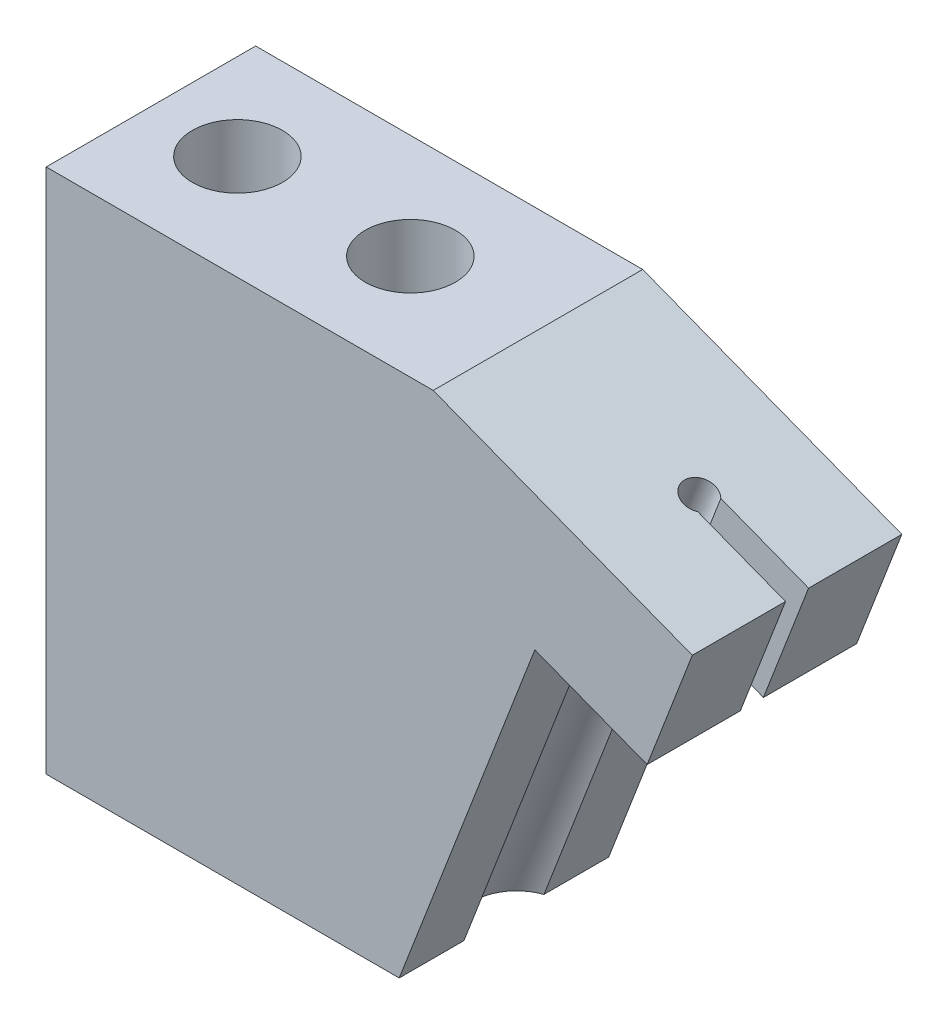
ISO-10303-21;
HEADER;
FILE_DESCRIPTION(('STEP AP214'),'2;1');
FILE_NAME('part.step','',(''),(''),'','','');
FILE_SCHEMA(('AUTOMOTIVE_DESIGN { 1 0 10303 214 1 1 1 1 }'));
ENDSEC;
DATA;
#1=APPLICATION_CONTEXT('core data for automotive mechanical design processes');
#2=APPLICATION_PROTOCOL_DEFINITION('international standard','automotive_design',2000,#1);
#3=PRODUCT_CONTEXT('',#1,'mechanical');
#4=PRODUCT('Part','Part','',(#3));
#5=PRODUCT_RELATED_PRODUCT_CATEGORY('part','',(#4));
#6=PRODUCT_DEFINITION_FORMATION('','',#4);
#7=PRODUCT_DEFINITION_CONTEXT('part definition',#1,'design');
#8=PRODUCT_DEFINITION('design','',#6,#7);
#9=PRODUCT_DEFINITION_SHAPE('','',#8);
#10=(LENGTH_UNIT() NAMED_UNIT(*) SI_UNIT(.MILLI.,.METRE.));
#11=(NAMED_UNIT(*) PLANE_ANGLE_UNIT() SI_UNIT($,.RADIAN.));
#12=(NAMED_UNIT(*) SI_UNIT($,.STERADIAN.) SOLID_ANGLE_UNIT());
#13=UNCERTAINTY_MEASURE_WITH_UNIT(LENGTH_MEASURE(1.E-05),#10,'distance_accuracy_value','');
#14=(GEOMETRIC_REPRESENTATION_CONTEXT(3) GLOBAL_UNCERTAINTY_ASSIGNED_CONTEXT((#13)) GLOBAL_UNIT_ASSIGNED_CONTEXT((#10,
#11,#12)) REPRESENTATION_CONTEXT('',''));
#15=CARTESIAN_POINT('',(0.,0.,0.));
#16=DIRECTION('',(0.,0.,1.));
#17=DIRECTION('',(1.,0.,0.));
#18=AXIS2_PLACEMENT_3D('',#15,#16,#17);
#19=CARTESIAN_POINT('',(-9.14111945311414,-0.764826871846283,-5.));
#20=DIRECTION('',(-0.359508265466264,-0.933141900817576,0.));
#21=DIRECTION('',(0.933141900817576,-0.359508265466264,0.));
#22=AXIS2_PLACEMENT_3D('',#19,#20,#21);
#23=PLANE('',#22);
#24=DIRECTION('',(0.933141900817576,-0.359508265466264,0.));
#25=VECTOR('',#24,1.);
#26=CARTESIAN_POINT('',(-25.2303841588295,5.43382698981338,-0.549999999999999));
#27=LINE('',#26,#25);
#28=CARTESIAN_POINT('',(0.404774537299763,-4.44253954106811,-0.549999999999999));
#29=VERTEX_POINT('',#28);
#30=CARTESIAN_POINT('',(3.22767644222282,-5.53010893060162,-0.549999999999999));
#31=VERTEX_POINT('',#30);
#32=EDGE_CURVE('E177',#29,#31,#27,.T.);
#33=ORIENTED_EDGE('',*,*,#32,.F.);
#34=CARTESIAN_POINT('',(-1.43803306186506,-3.73256760327029,0.));
#35=DIRECTION('',(0.359508265466264,0.933141900817576,0.));
#36=DIRECTION('',(-0.933141900817576,0.359508265466264,0.));
#37=AXIS2_PLACEMENT_3D('',#34,#35,#36);
#38=CIRCLE('',#37,2.05);
#39=CARTESIAN_POINT('',(-2.13322377797415,-3.46473394549793,-1.90983638042635));
#40=VERTEX_POINT('',#39);
#41=EDGE_CURVE('E262',#29,#40,#38,.T.);
#42=ORIENTED_EDGE('',*,*,#41,.T.);
#43=DIRECTION('',(0.,0.,1.));
#44=VECTOR('',#43,1.);
#45=CARTESIAN_POINT('',(-2.13322377797415,-3.46473394549793,-5.));
#46=LINE('',#45,#44);
#47=CARTESIAN_POINT('',(-2.13322377797415,-3.46473394549793,-5.));
#48=VERTEX_POINT('',#47);
#49=EDGE_CURVE('E310',#48,#40,#46,.T.);
#50=ORIENTED_EDGE('',*,*,#49,.F.);
#51=DIRECTION('',(-0.933141900817576,0.359508265466264,0.));
#52=VECTOR('',#51,1.);
#53=CARTESIAN_POINT('',(-9.14111945311414,-0.764826871846283,-5.));
#54=LINE('',#53,#52);
#55=CARTESIAN_POINT('',(3.22767644222282,-5.53010893060162,-5.));
#56=VERTEX_POINT('',#55);
#57=EDGE_CURVE('E275',#56,#48,#54,.T.);
#58=ORIENTED_EDGE('',*,*,#57,.F.);
#59=DIRECTION('',(0.,0.,-1.));
#60=VECTOR('',#59,1.);
#61=CARTESIAN_POINT('',(3.22767644222282,-5.53010893060162,5.));
#62=LINE('',#61,#60);
#63=EDGE_CURVE('E270',#31,#56,#62,.T.);
#64=ORIENTED_EDGE('',*,*,#63,.F.);
#65=EDGE_LOOP('',(#33,#42,#50,#58,#64));
#66=FACE_BOUND('',#65,.T.);
#67=ADVANCED_FACE('F39',(#66),#23,.T.);
#68=CARTESIAN_POINT('',(4.66570950408788,-1.79754132733131,5.));
#69=DIRECTION('',(-0.933141900817576,0.359508265466264,0.));
#70=DIRECTION('',(-0.359508265466264,-0.933141900817576,0.));
#71=AXIS2_PLACEMENT_3D('',#68,#69,#70);
#72=PLANE('',#71);
#73=DIRECTION('',(0.,0.,-1.));
#74=VECTOR('',#73,1.);
#75=CARTESIAN_POINT('',(5.38472603502041,0.0687424743038298,5.));
#76=LINE('',#75,#74);
#77=CARTESIAN_POINT('',(5.38472603502041,0.0687424743038294,-0.55));
#78=VERTEX_POINT('',#77);
#79=CARTESIAN_POINT('',(5.38472603502041,0.0687424743038298,-5.));
#80=VERTEX_POINT('',#79);
#81=EDGE_CURVE('E245',#78,#80,#76,.T.);
#82=ORIENTED_EDGE('',*,*,#81,.F.);
#83=DIRECTION('',(0.359508265466264,0.933141900817576,0.));
#84=VECTOR('',#83,1.);
#85=CARTESIAN_POINT('',(3.22767644222282,-5.53010893060162,-0.549999999999999));
#86=LINE('',#85,#84);
#87=EDGE_CURVE('E178',#31,#78,#86,.T.);
#88=ORIENTED_EDGE('',*,*,#87,.F.);
#89=ORIENTED_EDGE('',*,*,#63,.T.);
#90=DIRECTION('',(-0.359508265466264,-0.933141900817576,0.));
#91=VECTOR('',#90,1.);
#92=CARTESIAN_POINT('',(4.66570950408788,-1.79754132733131,-5.));
#93=LINE('',#92,#91);
#94=EDGE_CURVE('E279',#80,#56,#93,.T.);
#95=ORIENTED_EDGE('',*,*,#94,.F.);
#96=EDGE_LOOP('',(#82,#88,#89,#95));
#97=FACE_BOUND('',#96,.T.);
#98=ADVANCED_FACE('F383',(#97),#72,.F.);
#99=CARTESIAN_POINT('',(-25.4600826543059,-20.2689705628549,5.));
#100=DIRECTION('',(0.,1.,0.));
#101=DIRECTION('',(0.,0.,1.));
#102=AXIS2_PLACEMENT_3D('',#99,#100,#101);
#103=PLANE('',#102);
#104=CARTESIAN_POINT('',(-21.3325826543059,-20.2689705628549,0.));
#105=DIRECTION('',(0.,1.,0.));
#106=DIRECTION('',(0.,0.,1.));
#107=AXIS2_PLACEMENT_3D('',#104,#105,#106);
#108=CIRCLE('',#107,2.15265);
#109=CARTESIAN_POINT('',(-21.3325826543059,-20.2689705628549,2.15265));
#110=VERTEX_POINT('',#109);
#111=EDGE_CURVE('E291',#110,#110,#108,.F.);
#112=ORIENTED_EDGE('',*,*,#111,.F.);
#113=EDGE_LOOP('',(#112));
#114=FACE_BOUND('',#113,.T.);
#115=CARTESIAN_POINT('',(-13.0775826543059,-20.2689705628549,0.));
#116=DIRECTION('',(0.,1.,0.));
#117=DIRECTION('',(0.,0.,1.));
#118=AXIS2_PLACEMENT_3D('',#115,#116,#117);
#119=CIRCLE('',#118,2.15265);
#120=CARTESIAN_POINT('',(-13.0775826543059,-20.2689705628549,2.15265));
#121=VERTEX_POINT('',#120);
#122=EDGE_CURVE('E287',#121,#121,#119,.F.);
#123=ORIENTED_EDGE('',*,*,#122,.F.);
#124=EDGE_LOOP('',(#123));
#125=FACE_BOUND('',#124,.T.);
#126=CARTESIAN_POINT('',(-7.80895429028996,-20.2689705628549,0.));
#127=DIRECTION('',(0.,1.,0.));
#128=DIRECTION('',(1.,0.,0.));
#129=AXIS2_PLACEMENT_3D('',#126,#127,#128);
#130=ELLIPSE('',#129,2.19687916511292,2.05);
#131=CARTESIAN_POINT('',(-8.6073323283432,-20.2689705628549,1.90983638042634));
#132=VERTEX_POINT('',#131);
#133=CARTESIAN_POINT('',(-8.6073323283432,-20.2689705628549,-1.90983638042634));
#134=VERTEX_POINT('',#133);
#135=EDGE_CURVE('E208',#132,#134,#130,.F.);
#136=ORIENTED_EDGE('',*,*,#135,.F.);
#137=DIRECTION('',(0.,0.,1.));
#138=VECTOR('',#137,1.);
#139=CARTESIAN_POINT('',(-8.6073323283432,-20.2689705628549,-5.));
#140=LINE('',#139,#138);
#141=CARTESIAN_POINT('',(-8.6073323283432,-20.2689705628549,5.));
#142=VERTEX_POINT('',#141);
#143=EDGE_CURVE('E309',#132,#142,#140,.T.);
#144=ORIENTED_EDGE('',*,*,#143,.T.);
#145=DIRECTION('',(1.,0.,0.));
#146=VECTOR('',#145,1.);
#147=CARTESIAN_POINT('',(-25.4600826543059,-20.2689705628549,5.));
#148=LINE('',#147,#146);
#149=CARTESIAN_POINT('',(-25.4600826543059,-20.2689705628549,5.));
#150=VERTEX_POINT('',#149);
#151=EDGE_CURVE('E53',#150,#142,#148,.T.);
#152=ORIENTED_EDGE('',*,*,#151,.F.);
#153=DIRECTION('',(0.,0.,-1.));
#154=VECTOR('',#153,1.);
#155=CARTESIAN_POINT('',(-25.4600826543059,-20.2689705628549,5.));
#156=LINE('',#155,#154);
#157=CARTESIAN_POINT('',(-25.4600826543059,-20.2689705628549,-5.));
#158=VERTEX_POINT('',#157);
#159=EDGE_CURVE('E11',#150,#158,#156,.T.);
#160=ORIENTED_EDGE('',*,*,#159,.T.);
#161=DIRECTION('',(1.,0.,0.));
#162=VECTOR('',#161,1.);
#163=CARTESIAN_POINT('',(-25.4600826543059,-20.2689705628549,-5.));
#164=LINE('',#163,#162);
#165=CARTESIAN_POINT('',(-8.6073323283432,-20.2689705628549,-5.));
#166=VERTEX_POINT('',#165);
#167=EDGE_CURVE('E316',#158,#166,#164,.T.);
#168=ORIENTED_EDGE('',*,*,#167,.T.);
#169=EDGE_CURVE('E304',#166,#134,#140,.T.);
#170=ORIENTED_EDGE('',*,*,#169,.T.);
#171=EDGE_LOOP('',(#136,#144,#152,#160,#168,#170));
#172=FACE_BOUND('',#171,.T.);
#173=ADVANCED_FACE('F333',(#114,#125,#172),#103,.F.);
#174=CARTESIAN_POINT('',(-8.6073323283432,-20.2689705628549,-5.));
#175=DIRECTION('',(-0.933141900817575,0.359508265466265,0.));
#176=DIRECTION('',(-0.359508265466265,-0.933141900817575,0.));
#177=AXIS2_PLACEMENT_3D('',#174,#175,#176);
#178=PLANE('',#177);
#179=DIRECTION('',(0.359508265466264,0.933141900817576,0.));
#180=VECTOR('',#179,1.);
#181=CARTESIAN_POINT('',(-10.785486148518,-25.9226002322448,1.90983638042634));
#182=LINE('',#181,#180);
#183=CARTESIAN_POINT('',(-2.13322377797415,-3.46473394549793,1.90983638042634));
#184=VERTEX_POINT('',#183);
#185=EDGE_CURVE('E211',#184,#132,#182,.F.);
#186=ORIENTED_EDGE('',*,*,#185,.F.);
#187=CARTESIAN_POINT('',(-2.13322377797415,-3.46473394549793,5.));
#188=VERTEX_POINT('',#187);
#189=EDGE_CURVE('E303',#184,#188,#46,.T.);
#190=ORIENTED_EDGE('',*,*,#189,.T.);
#191=DIRECTION('',(-0.359508265466265,-0.933141900817575,0.));
#192=VECTOR('',#191,1.);
#193=CARTESIAN_POINT('',(-8.6073323283432,-20.2689705628549,5.));
#194=LINE('',#193,#192);
#195=EDGE_CURVE('E295',#188,#142,#194,.T.);
#196=ORIENTED_EDGE('',*,*,#195,.T.);
#197=ORIENTED_EDGE('',*,*,#143,.F.);
#198=EDGE_LOOP('',(#186,#190,#196,#197));
#199=FACE_BOUND('',#198,.T.);
#200=ADVANCED_FACE('F339',(#199),#178,.F.);
#201=DIRECTION('',(0.359508265466264,0.933141900817576,0.));
#202=VECTOR('',#201,1.);
#203=CARTESIAN_POINT('',(-10.785486148518,-25.9226002322448,-1.90983638042634));
#204=LINE('',#203,#202);
#205=EDGE_CURVE('E194',#134,#40,#204,.T.);
#206=ORIENTED_EDGE('',*,*,#205,.F.);
#207=ORIENTED_EDGE('',*,*,#169,.F.);
#208=DIRECTION('',(-0.359508265466265,-0.933141900817575,0.));
#209=VECTOR('',#208,1.);
#210=CARTESIAN_POINT('',(-8.6073323283432,-20.2689705628549,-5.));
#211=LINE('',#210,#209);
#212=EDGE_CURVE('E299',#48,#166,#211,.T.);
#213=ORIENTED_EDGE('',*,*,#212,.F.);
#214=ORIENTED_EDGE('',*,*,#49,.T.);
#215=EDGE_LOOP('',(#206,#207,#213,#214));
#216=FACE_BOUND('',#215,.T.);
#217=ADVANCED_FACE('F366',(#216),#178,.F.);
#218=CARTESIAN_POINT('',(-25.4600826543059,-0.268970562854885,5.));
#219=DIRECTION('',(1.,0.,0.));
#220=DIRECTION('',(0.,1.,0.));
#221=AXIS2_PLACEMENT_3D('',#218,#219,#220);
#222=PLANE('',#221);
#223=DIRECTION('',(0.,-1.,0.));
#224=VECTOR('',#223,1.);
#225=CARTESIAN_POINT('',(-25.4600826543059,-0.268970562854885,-5.));
#226=LINE('',#225,#224);
#227=CARTESIAN_POINT('',(-25.4600826543059,4.83402453305916,-5.));
#228=VERTEX_POINT('',#227);
#229=EDGE_CURVE('E308',#228,#158,#226,.T.);
#230=ORIENTED_EDGE('',*,*,#229,.T.);
#231=ORIENTED_EDGE('',*,*,#159,.F.);
#232=DIRECTION('',(0.,-1.,0.));
#233=VECTOR('',#232,1.);
#234=CARTESIAN_POINT('',(-25.4600826543059,-0.268970562854885,5.));
#235=LINE('',#234,#233);
#236=CARTESIAN_POINT('',(-25.4600826543059,4.83402453305916,5.));
#237=VERTEX_POINT('',#236);
#238=EDGE_CURVE('E320',#237,#150,#235,.T.);
#239=ORIENTED_EDGE('',*,*,#238,.F.);
#240=DIRECTION('',(0.,0.,1.));
#241=VECTOR('',#240,1.);
#242=CARTESIAN_POINT('',(-25.4600826543059,4.83402453305916,-5.));
#243=LINE('',#242,#241);
#244=EDGE_CURVE('E222',#228,#237,#243,.T.);
#245=ORIENTED_EDGE('',*,*,#244,.F.);
#246=EDGE_LOOP('',(#230,#231,#239,#245));
#247=FACE_BOUND('',#246,.T.);
#248=ADVANCED_FACE('F41',(#247),#222,.F.);
#249=CARTESIAN_POINT('',(-7.70308639124909,2.96774073142401,5.));
#250=DIRECTION('',(0.,0.,1.));
#251=DIRECTION('',(1.,0.,0.));
#252=AXIS2_PLACEMENT_3D('',#249,#250,#251);
#253=PLANE('',#252);
#254=DIRECTION('',(1.,0.,0.));
#255=VECTOR('',#254,1.);
#256=CARTESIAN_POINT('',(-25.4600826543059,4.83402453305916,5.));
#257=LINE('',#256,#255);
#258=CARTESIAN_POINT('',(-6.98406986031655,4.83402453305916,5.));
#259=VERTEX_POINT('',#258);
#260=EDGE_CURVE('E226',#237,#259,#257,.T.);
#261=ORIENTED_EDGE('',*,*,#260,.F.);
#262=ORIENTED_EDGE('',*,*,#238,.T.);
#263=ORIENTED_EDGE('',*,*,#151,.T.);
#264=ORIENTED_EDGE('',*,*,#195,.F.);
#265=DIRECTION('',(0.933141900817576,-0.359508265466264,0.));
#266=VECTOR('',#265,1.);
#267=CARTESIAN_POINT('',(-1.43803306186506,-3.73256760327029,5.));
#268=LINE('',#267,#266);
#269=CARTESIAN_POINT('',(3.22767644222282,-5.53010893060162,5.));
#270=VERTEX_POINT('',#269);
#271=EDGE_CURVE('E267',#188,#270,#268,.T.);
#272=ORIENTED_EDGE('',*,*,#271,.T.);
#273=DIRECTION('',(-0.359508265466264,-0.933141900817576,0.));
#274=VECTOR('',#273,1.);
#275=CARTESIAN_POINT('',(4.66570950408788,-1.79754132733131,5.));
#276=LINE('',#275,#274);
#277=CARTESIAN_POINT('',(5.38472603502041,0.0687424743038298,5.));
#278=VERTEX_POINT('',#277);
#279=EDGE_CURVE('E283',#278,#270,#276,.T.);
#280=ORIENTED_EDGE('',*,*,#279,.F.);
#281=DIRECTION('',(0.933141900817576,-0.359508265466264,0.));
#282=VECTOR('',#281,1.);
#283=CARTESIAN_POINT('',(0.719016530932528,1.86628380163515,5.));
#284=LINE('',#283,#282);
#285=EDGE_CURVE('E241',#259,#278,#284,.T.);
#286=ORIENTED_EDGE('',*,*,#285,.F.);
#287=EDGE_LOOP('',(#261,#262,#263,#264,#272,#280,#286));
#288=FACE_BOUND('',#287,.T.);
#289=ADVANCED_FACE('F329',(#288),#253,.T.);
#290=CARTESIAN_POINT('',(-7.70308639124909,2.96774073142401,-5.));
#291=DIRECTION('',(0.,0.,1.));
#292=DIRECTION('',(1.,0.,0.));
#293=AXIS2_PLACEMENT_3D('',#290,#291,#292);
#294=PLANE('',#293);
#295=ORIENTED_EDGE('',*,*,#229,.F.);
#296=DIRECTION('',(-1.,0.,0.));
#297=VECTOR('',#296,1.);
#298=CARTESIAN_POINT('',(-25.4600826543059,4.83402453305916,-5.));
#299=LINE('',#298,#297);
#300=CARTESIAN_POINT('',(-6.98406986031655,4.83402453305916,-5.));
#301=VERTEX_POINT('',#300);
#302=EDGE_CURVE('E229',#301,#228,#299,.T.);
#303=ORIENTED_EDGE('',*,*,#302,.F.);
#304=DIRECTION('',(-0.933141900817576,0.359508265466264,0.));
#305=VECTOR('',#304,1.);
#306=CARTESIAN_POINT('',(5.38472603502041,0.0687424743038298,-5.));
#307=LINE('',#306,#305);
#308=EDGE_CURVE('E250',#80,#301,#307,.T.);
#309=ORIENTED_EDGE('',*,*,#308,.F.);
#310=ORIENTED_EDGE('',*,*,#94,.T.);
#311=ORIENTED_EDGE('',*,*,#57,.T.);
#312=ORIENTED_EDGE('',*,*,#212,.T.);
#313=ORIENTED_EDGE('',*,*,#167,.F.);
#314=EDGE_LOOP('',(#295,#303,#309,#310,#311,#312,#313));
#315=FACE_BOUND('',#314,.T.);
#316=ADVANCED_FACE('F361',(#315),#294,.F.);
#317=CARTESIAN_POINT('',(-21.3325826543059,-26.3575842129398,0.));
#318=DIRECTION('',(0.,1.,0.));
#319=DIRECTION('',(-1.,0.,0.));
#320=AXIS2_PLACEMENT_3D('',#317,#318,#319);
#321=CYLINDRICAL_SURFACE('',#320,2.15265);
#322=ORIENTED_EDGE('',*,*,#111,.T.);
#323=EDGE_LOOP('',(#322));
#324=FACE_BOUND('',#323,.T.);
#325=CARTESIAN_POINT('',(-21.3325826543059,4.83402453305916,0.));
#326=DIRECTION('',(0.,1.,0.));
#327=DIRECTION('',(0.,0.,1.));
#328=AXIS2_PLACEMENT_3D('',#325,#326,#327);
#329=CIRCLE('',#328,2.15265);
#330=CARTESIAN_POINT('',(-21.3325826543059,4.83402453305916,2.15265));
#331=VERTEX_POINT('',#330);
#332=EDGE_CURVE('E218',#331,#331,#329,.T.);
#333=ORIENTED_EDGE('',*,*,#332,.T.);
#334=EDGE_LOOP('',(#333));
#335=FACE_BOUND('',#334,.T.);
#336=ADVANCED_FACE('F410',(#324,#335),#321,.F.);
#337=CARTESIAN_POINT('',(-13.0775826543059,-26.3575842129398,0.));
#338=DIRECTION('',(0.,1.,0.));
#339=DIRECTION('',(-1.,0.,0.));
#340=AXIS2_PLACEMENT_3D('',#337,#338,#339);
#341=CYLINDRICAL_SURFACE('',#340,2.15265);
#342=ORIENTED_EDGE('',*,*,#122,.T.);
#343=EDGE_LOOP('',(#342));
#344=FACE_BOUND('',#343,.T.);
#345=CARTESIAN_POINT('',(-13.0775826543059,4.83402453305916,0.));
#346=DIRECTION('',(0.,1.,0.));
#347=DIRECTION('',(0.,0.,1.));
#348=AXIS2_PLACEMENT_3D('',#345,#346,#347);
#349=CIRCLE('',#348,2.15265);
#350=CARTESIAN_POINT('',(-13.0775826543059,4.83402453305916,2.15265));
#351=VERTEX_POINT('',#350);
#352=EDGE_CURVE('E214',#351,#351,#349,.T.);
#353=ORIENTED_EDGE('',*,*,#352,.T.);
#354=EDGE_LOOP('',(#353));
#355=FACE_BOUND('',#354,.T.);
#356=ADVANCED_FACE('F406',(#344,#355),#341,.F.);
#357=DIRECTION('',(0.933141900817576,-0.359508265466264,0.));
#358=VECTOR('',#357,1.);
#359=CARTESIAN_POINT('',(-25.2303841588295,5.43382698981338,0.549999999999999));
#360=LINE('',#359,#358);
#361=CARTESIAN_POINT('',(0.404774537299763,-4.44253954106811,0.55));
#362=VERTEX_POINT('',#361);
#363=CARTESIAN_POINT('',(3.22767644222282,-5.53010893060162,0.549999999999999));
#364=VERTEX_POINT('',#363);
#365=EDGE_CURVE('E173',#362,#364,#360,.T.);
#366=ORIENTED_EDGE('',*,*,#365,.T.);
#367=EDGE_CURVE('E271',#270,#364,#62,.T.);
#368=ORIENTED_EDGE('',*,*,#367,.F.);
#369=ORIENTED_EDGE('',*,*,#271,.F.);
#370=ORIENTED_EDGE('',*,*,#189,.F.);
#371=EDGE_CURVE('E263',#184,#362,#38,.T.);
#372=ORIENTED_EDGE('',*,*,#371,.T.);
#373=EDGE_LOOP('',(#366,#368,#369,#370,#372));
#374=FACE_BOUND('',#373,.T.);
#375=ADVANCED_FACE('F344',(#374),#23,.T.);
#376=ORIENTED_EDGE('',*,*,#367,.T.);
#377=DIRECTION('',(-0.359508265466264,-0.933141900817576,0.));
#378=VECTOR('',#377,1.);
#379=CARTESIAN_POINT('',(5.38472603502041,0.0687424743038294,0.55));
#380=LINE('',#379,#378);
#381=CARTESIAN_POINT('',(5.38472603502041,0.0687424743038294,0.55));
#382=VERTEX_POINT('',#381);
#383=EDGE_CURVE('E182',#382,#364,#380,.T.);
#384=ORIENTED_EDGE('',*,*,#383,.F.);
#385=EDGE_CURVE('E246',#278,#382,#76,.T.);
#386=ORIENTED_EDGE('',*,*,#385,.F.);
#387=ORIENTED_EDGE('',*,*,#279,.T.);
#388=EDGE_LOOP('',(#376,#384,#386,#387));
#389=FACE_BOUND('',#388,.T.);
#390=ADVANCED_FACE('F349',(#389),#72,.F.);
#391=CARTESIAN_POINT('',(0.,0.,0.));
#392=DIRECTION('',(-0.359508265466264,-0.933141900817576,0.));
#393=DIRECTION('',(0.933141900817576,-0.359508265466264,0.));
#394=AXIS2_PLACEMENT_3D('',#391,#392,#393);
#395=CYLINDRICAL_SURFACE('',#394,2.05);
#396=CARTESIAN_POINT('',(-3.96240199574311,-4.58374415261255,0.0410269121573492));
#397=CARTESIAN_POINT('',(-3.96086253862863,-4.58434485093049,0.123232021144441));
#398=CARTESIAN_POINT('',(-3.95679653519129,-4.59224475780981,0.205419211135883));
#399=CARTESIAN_POINT('',(-3.94388837330644,-4.62200602324585,0.366883366517385));
#400=CARTESIAN_POINT('',(-3.93503826686086,-4.64389062611854,0.446155253881094));
#401=CARTESIAN_POINT('',(-3.91337519707157,-4.69982799704871,0.599037417287345));
#402=CARTESIAN_POINT('',(-3.90058875334421,-4.73379956528104,0.672681583405222));
#403=CARTESIAN_POINT('',(-3.87199003738262,-4.81198980879967,0.813580490835075));
#404=CARTESIAN_POINT('',(-3.85617735316538,-4.85620987945853,0.880834360324159));
#405=CARTESIAN_POINT('',(-3.8159882964283,-4.97189867657157,1.03316189245123));
#406=CARTESIAN_POINT('',(-3.7906706201033,-5.04728109395308,1.11501660520695));
#407=CARTESIAN_POINT('',(-3.73892546292836,-5.21043917056163,1.2650623816007));
#408=CARTESIAN_POINT('',(-3.71249491378897,-5.29825091668697,1.33321220860468));
#409=CARTESIAN_POINT('',(-3.66133052005429,-5.48548894746861,1.45714507563779));
#410=CARTESIAN_POINT('',(-3.63664299959921,-5.58511767502157,1.51264359045952));
#411=CARTESIAN_POINT('',(-3.60557531423747,-5.7406217339553,1.58494221837851));
#412=CARTESIAN_POINT('',(-3.59621847811857,-5.79342176062866,1.60720341088002));
#413=CARTESIAN_POINT('',(-3.58060798653713,-5.90088798974145,1.64794109602323));
#414=CARTESIAN_POINT('',(-3.57435140594049,-5.95555238086589,1.66642114652039));
#415=CARTESIAN_POINT('',(-3.56640057315348,-6.06697596947095,1.69944867876035));
#416=CARTESIAN_POINT('',(-3.56474828411487,-6.12374968594839,1.71395890965195));
#417=CARTESIAN_POINT('',(-3.56819255704426,-6.23807350938391,1.73823435656198));
#418=CARTESIAN_POINT('',(-3.57327450177471,-6.2956216672649,1.74800978705338));
#419=CARTESIAN_POINT('',(-3.59247127623504,-6.41086820926931,1.76221295039118));
#420=CARTESIAN_POINT('',(-3.60671601046951,-6.4685566728309,1.76656108877676));
#421=CARTESIAN_POINT('',(-3.64526135995964,-6.58060582876931,1.76909716267946));
#422=CARTESIAN_POINT('',(-3.66955420047242,-6.63496905680451,1.76728985318259));
#423=CARTESIAN_POINT('',(-3.72234781514916,-6.73078576682057,1.75848046425375));
#424=CARTESIAN_POINT('',(-3.74970670628413,-6.77296268606392,1.75228024900743));
#425=CARTESIAN_POINT('',(-3.80883027747151,-6.85331309641334,1.73604837230257));
#426=CARTESIAN_POINT('',(-3.84060135539846,-6.89148062996087,1.72601110922046));
#427=CARTESIAN_POINT('',(-3.93522692675527,-6.99518950872953,1.69254372130441));
#428=CARTESIAN_POINT('',(-4.00145793260843,-7.05627586217299,1.66499603580557));
#429=CARTESIAN_POINT('',(-4.13683264896078,-7.16942137797135,1.59996586545188));
#430=CARTESIAN_POINT('',(-4.20598723006451,-7.221442333567,1.56244293941421));
#431=CARTESIAN_POINT('',(-4.32085012702678,-7.30259929833973,1.49188192572433));
#432=CARTESIAN_POINT('',(-4.36680650114972,-7.33364372144908,1.46141187244646));
#433=CARTESIAN_POINT('',(-4.45752074785117,-7.3929415724258,1.39625855024936));
#434=CARTESIAN_POINT('',(-4.50227817384024,-7.42119397056166,1.36157373731492));
#435=CARTESIAN_POINT('',(-4.63345283368909,-7.50194978792513,1.2512897842245));
#436=CARTESIAN_POINT('',(-4.71706768260419,-7.55065088771765,1.16928589068206));
#437=CARTESIAN_POINT('',(-4.85015331133233,-7.62581817908451,1.0123190345056));
#438=CARTESIAN_POINT('',(-4.90280880245077,-7.65475952196042,0.941218772786933));
#439=CARTESIAN_POINT('',(-4.997890736918,-7.70600749787651,0.790286892701333));
#440=CARTESIAN_POINT('',(-5.04033110635126,-7.72832317337628,0.710467379582038));
#441=CARTESIAN_POINT('',(-5.10656993331499,-7.76241767562099,0.556211216088061));
#442=CARTESIAN_POINT('',(-5.13222660173411,-7.77528591490684,0.482817750363618));
#443=CARTESIAN_POINT('',(-5.17247208887514,-7.79481035366773,0.332245055895039));
#444=CARTESIAN_POINT('',(-5.1870668917888,-7.80146991233248,0.255067898127994));
#445=CARTESIAN_POINT('',(-5.20414422038159,-7.80811871999175,0.0988238871702526));
#446=CARTESIAN_POINT('',(-5.20658707388813,-7.80808613592995,0.0197516902553536));
#447=CARTESIAN_POINT('',(-5.19909680397049,-7.80120933141853,-0.137498053016137));
#448=CARTESIAN_POINT('',(-5.18916315941551,-7.79436482414521,-0.215675561560666));
#449=CARTESIAN_POINT('',(-5.15857009185214,-7.77471544387056,-0.364881398379115));
#450=CARTESIAN_POINT('',(-5.1384792198224,-7.76222991259437,-0.436071286989154));
#451=CARTESIAN_POINT('',(-5.08923543257029,-7.73194076378388,-0.574023322080143));
#452=CARTESIAN_POINT('',(-5.0600783162455,-7.71413468097017,-0.640783398443887));
#453=CARTESIAN_POINT('',(-4.9826875496608,-7.6666690924396,-0.791398380902165));
#454=CARTESIAN_POINT('',(-4.93134972495654,-7.63504253223352,-0.873039365637475));
#455=CARTESIAN_POINT('',(-4.8187365448922,-7.56416688813792,-1.02544505190657));
#456=CARTESIAN_POINT('',(-4.75744458506233,-7.52490504586492,-1.09619118883591));
#457=CARTESIAN_POINT('',(-4.62743186447717,-7.43854731262576,-1.22750098926634));
#458=CARTESIAN_POINT('',(-4.5586111611047,-7.391339998872,-1.28789089697923));
#459=CARTESIAN_POINT('',(-4.41774397217248,-7.28900146895636,-1.39711227204745));
#460=CARTESIAN_POINT('',(-4.34569776054945,-7.23387092482482,-1.4459447187515));
#461=CARTESIAN_POINT('',(-4.21800206316222,-7.1268813581955,-1.52233470681442));
#462=CARTESIAN_POINT('',(-4.1621742711983,-7.07689064486663,-1.55220932451025));
#463=CARTESIAN_POINT('',(-4.05400347059532,-6.9694736045711,-1.60388239955792));
#464=CARTESIAN_POINT('',(-4.00165383850757,-6.91206206154199,-1.62569659028402));
#465=CARTESIAN_POINT('',(-3.91727325008384,-6.80433991769591,-1.65556796136907));
#466=CARTESIAN_POINT('',(-3.88348389707405,-6.75601619209992,-1.66572211891276));
#467=CARTESIAN_POINT('',(-3.82250377003108,-6.65461544991424,-1.68020775252244));
#468=CARTESIAN_POINT('',(-3.79529867846493,-6.60154909689046,-1.68455195727126));
#469=CARTESIAN_POINT('',(-3.74906147422165,-6.49154758396743,-1.68704427469807));
#470=CARTESIAN_POINT('',(-3.73006414759503,-6.43459711946494,-1.68516630226055));
#471=CARTESIAN_POINT('',(-3.70058321617875,-6.31901008079118,-1.67534540480297));
#472=CARTESIAN_POINT('',(-3.69011442031141,-6.26037075604909,-1.66739197656345));
#473=CARTESIAN_POINT('',(-3.674030227044,-6.12298897166425,-1.64232917470177));
#474=CARTESIAN_POINT('',(-3.67136008255263,-6.0443324231874,-1.62300017644788));
#475=CARTESIAN_POINT('',(-3.67475331186214,-5.8897105920154,-1.57589556273269));
#476=CARTESIAN_POINT('',(-3.68084726678894,-5.81375568529389,-1.54809063883693));
#477=CARTESIAN_POINT('',(-3.69604986866261,-5.68478805383286,-1.49301989801744));
#478=CARTESIAN_POINT('',(-3.70398252823943,-5.63089256310422,-1.46744913676394));
#479=CARTESIAN_POINT('',(-3.72174458024796,-5.52552922399804,-1.41226594755775));
#480=CARTESIAN_POINT('',(-3.73157485348628,-5.47406251683734,-1.38265164460843));
#481=CARTESIAN_POINT('',(-3.76266267556287,-5.3238093467325,-1.28788690228334));
#482=CARTESIAN_POINT('',(-3.78554173245784,-5.22900417215151,-1.21674412245758));
#483=CARTESIAN_POINT('',(-3.82692462750179,-5.06880834830726,-1.07257766939902));
#484=CARTESIAN_POINT('',(-3.84549455683954,-5.00117243229542,-1.00205378842754));
#485=CARTESIAN_POINT('',(-3.8802686164391,-4.87804943760317,-0.850558274491776));
#486=CARTESIAN_POINT('',(-3.89647633512824,-4.82254386630229,-0.769602848141066));
#487=CARTESIAN_POINT('',(-3.92195801144799,-4.73573116846682,-0.61426129172887));
#488=CARTESIAN_POINT('',(-3.93196030594728,-4.70184583367072,-0.541438085552833));
#489=CARTESIAN_POINT('',(-3.94812225497012,-4.64610267661061,-0.390968056895013));
#490=CARTESIAN_POINT('',(-3.95428946380388,-4.62422121932539,-0.313331050637216));
#491=CARTESIAN_POINT('',(-3.9604231160554,-4.60033964731891,-0.189048185241458));
#492=CARTESIAN_POINT('',(-3.96191223021717,-4.59384059029508,-0.143302211152822));
#493=CARTESIAN_POINT('',(-3.9633343259119,-4.58537364369935,-0.0513600245944996));
#494=CARTESIAN_POINT('',(-3.96326700899687,-4.58340662323181,-0.00516372747225571));
#495=CARTESIAN_POINT('',(-3.96240199574311,-4.58374415261255,0.0410269121573492));
#496=B_SPLINE_CURVE_WITH_KNOTS('',3,(#396,#397,#398,#399,#400,#401,#402,#403,#404,#405,#406,
#407,#408,#409,#410,#411,#412,#413,#414,#415,#416,#417,#418,#419,#420,#421,#422,#423,#424,#425,
#426,#427,#428,#429,#430,#431,#432,#433,#434,#435,#436,#437,#438,#439,#440,#441,#442,#443,#444,
#445,#446,#447,#448,#449,#450,#451,#452,#453,#454,#455,#456,#457,#458,#459,#460,#461,#462,#463,
#464,#465,#466,#467,#468,#469,#470,#471,#472,#473,#474,#475,#476,#477,#478,#479,#480,#481,#482,
#483,#484,#485,#486,#487,#488,#489,#490,#491,#492,#493,#494,#495),.UNSPECIFIED.,.T.,.F.,(4,2,2,
2,2,2,2,2,2,2,2,2,2,2,2,2,2,2,2,2,2,2,2,2,2,2,2,2,2,2,2,2,2,2,2,2,2,2,2,2,2,2,2,2,2,2,2,2,2,4),
(0.,0.246463830562803,0.493338384194752,0.738584821424743,0.9838646695264,1.32437275450156,
1.66589054970143,2.01446272176885,2.18846959624913,2.36231197872537,2.53773364479427,
2.7127751659617,2.89035471336177,3.06779711449649,3.21918092968495,3.37078659608007,
3.65184760040281,3.93406592218242,4.12368586908691,4.31337549107981,4.69157764729015,
4.96987016876955,5.24778112268467,5.48319699317338,5.71848541850293,5.95454148238862,
6.19060748610079,6.41472064420908,6.63893780667993,6.94177452963305,7.24512170274033,
7.55314453347424,7.86114125381461,8.10256891406755,8.34352280381554,8.52233866584595,
8.70076212547155,8.87993453126599,9.05941739246693,9.30118949091735,9.5438072696884,
9.72412313072883,9.90452289028417,10.2647835415784,10.5621077870008,10.8589755520467,
11.1008271115886,11.3422007528401,11.48066099648,11.6191477903001),.UNSPECIFIED.);
#497=CARTESIAN_POINT('',(-3.96240199574311,-4.58374415261255,0.0410269121573492));
#498=VERTEX_POINT('',#497);
#499=EDGE_CURVE('E43',#498,#498,#496,.T.);
#500=ORIENTED_EDGE('',*,*,#499,.F.);
#501=EDGE_LOOP('',(#500));
#502=FACE_BOUND('',#501,.T.);
#503=DIRECTION('',(-0.359508265466264,-0.933141900817576,0.));
#504=VECTOR('',#503,1.);
#505=CARTESIAN_POINT('',(1.84280759916482,-0.709971937797811,-0.55));
#506=LINE('',#505,#504);
#507=CARTESIAN_POINT('',(1.84280759916482,-0.709971937797819,-0.55));
#508=VERTEX_POINT('',#507);
#509=EDGE_CURVE('E185',#29,#508,#506,.F.);
#510=ORIENTED_EDGE('',*,*,#509,.T.);
#511=CARTESIAN_POINT('',(0.,0.,0.));
#512=DIRECTION('',(0.359508265466264,0.933141900817576,0.));
#513=DIRECTION('',(-0.933141900817576,0.359508265466264,0.));
#514=AXIS2_PLACEMENT_3D('',#511,#512,#513);
#515=CIRCLE('',#514,2.05);
#516=CARTESIAN_POINT('',(1.84280759916482,-0.709971937797819,0.55));
#517=VERTEX_POINT('',#516);
#518=EDGE_CURVE('E258',#508,#517,#515,.T.);
#519=ORIENTED_EDGE('',*,*,#518,.T.);
#520=DIRECTION('',(-0.359508265466264,-0.933141900817576,0.));
#521=VECTOR('',#520,1.);
#522=CARTESIAN_POINT('',(1.84280759916482,-0.709971937797811,0.55));
#523=LINE('',#522,#521);
#524=EDGE_CURVE('E170',#517,#362,#523,.T.);
#525=ORIENTED_EDGE('',*,*,#524,.T.);
#526=ORIENTED_EDGE('',*,*,#371,.F.);
#527=ORIENTED_EDGE('',*,*,#185,.T.);
#528=ORIENTED_EDGE('',*,*,#135,.T.);
#529=ORIENTED_EDGE('',*,*,#205,.T.);
#530=ORIENTED_EDGE('',*,*,#41,.F.);
#531=EDGE_LOOP('',(#510,#519,#525,#526,#527,#528,#529,#530));
#532=FACE_BOUND('',#531,.T.);
#533=ADVANCED_FACE('F369',(#502,#532),#395,.F.);
#534=CARTESIAN_POINT('',(5.38472603502041,0.0687424743038298,5.));
#535=DIRECTION('',(0.359508265466264,0.933141900817576,0.));
#536=DIRECTION('',(-0.933141900817576,0.359508265466264,0.));
#537=AXIS2_PLACEMENT_3D('',#534,#535,#536);
#538=PLANE('',#537);
#539=DIRECTION('',(0.933141900817576,-0.359508265466264,0.));
#540=VECTOR('',#539,1.);
#541=CARTESIAN_POINT('',(-23.0733345660319,11.0326783947188,-0.55));
#542=LINE('',#541,#540);
#543=CARTESIAN_POINT('',(1.19482740705452,1.68296983554411,-0.55));
#544=VERTEX_POINT('',#543);
#545=EDGE_CURVE('E68',#544,#78,#542,.T.);
#546=ORIENTED_EDGE('',*,*,#545,.T.);
#547=ORIENTED_EDGE('',*,*,#81,.T.);
#548=ORIENTED_EDGE('',*,*,#308,.T.);
#549=DIRECTION('',(0.,0.,1.));
#550=VECTOR('',#549,1.);
#551=CARTESIAN_POINT('',(-6.98406986031655,4.83402453305916,5.));
#552=LINE('',#551,#550);
#553=EDGE_CURVE('E254',#301,#259,#552,.T.);
#554=ORIENTED_EDGE('',*,*,#553,.T.);
#555=ORIENTED_EDGE('',*,*,#285,.T.);
#556=ORIENTED_EDGE('',*,*,#385,.T.);
#557=DIRECTION('',(0.933141900817576,-0.359508265466264,0.));
#558=VECTOR('',#557,1.);
#559=CARTESIAN_POINT('',(-23.0733345660319,11.0326783947188,0.55));
#560=LINE('',#559,#558);
#561=CARTESIAN_POINT('',(1.19482740705452,1.68296983554411,0.55));
#562=VERTEX_POINT('',#561);
#563=EDGE_CURVE('E168',#562,#382,#560,.T.);
#564=ORIENTED_EDGE('',*,*,#563,.F.);
#565=CARTESIAN_POINT('',(0.719016530932529,1.86628380163515,0.));
#566=DIRECTION('',(0.359508265466264,0.933141900817576,0.));
#567=DIRECTION('',(-0.933141900817576,0.359508265466264,0.));
#568=AXIS2_PLACEMENT_3D('',#565,#566,#567);
#569=CIRCLE('',#568,0.75);
#570=EDGE_CURVE('E237',#544,#562,#569,.T.);
#571=ORIENTED_EDGE('',*,*,#570,.F.);
#572=EDGE_LOOP('',(#546,#547,#548,#554,#555,#556,#564,#571));
#573=FACE_BOUND('',#572,.T.);
#574=ADVANCED_FACE('F353',(#573),#538,.T.);
#575=CARTESIAN_POINT('',(4.66570950408788,-1.79754132733132,5.));
#576=DIRECTION('',(0.359508265466264,0.933141900817576,0.));
#577=DIRECTION('',(-0.933141900817576,0.359508265466264,0.));
#578=AXIS2_PLACEMENT_3D('',#575,#576,#577);
#579=PLANE('',#578);
#580=ORIENTED_EDGE('',*,*,#518,.F.);
#581=DIRECTION('',(0.933141900817576,-0.359508265466264,0.));
#582=VECTOR('',#581,1.);
#583=CARTESIAN_POINT('',(-23.7923510969644,9.16639459308368,-0.55));
#584=LINE('',#583,#582);
#585=CARTESIAN_POINT('',(0.475810876121989,-0.183313966091038,-0.55));
#586=VERTEX_POINT('',#585);
#587=EDGE_CURVE('E181',#586,#508,#584,.T.);
#588=ORIENTED_EDGE('',*,*,#587,.F.);
#589=CARTESIAN_POINT('',(0.,0.,0.));
#590=DIRECTION('',(0.359508265466264,0.933141900817576,0.));
#591=DIRECTION('',(-0.933141900817576,0.359508265466264,0.));
#592=AXIS2_PLACEMENT_3D('',#589,#590,#591);
#593=CIRCLE('',#592,0.75);
#594=CARTESIAN_POINT('',(0.475810876121988,-0.183313966091038,0.55));
#595=VERTEX_POINT('',#594);
#596=EDGE_CURVE('E233',#586,#595,#593,.T.);
#597=ORIENTED_EDGE('',*,*,#596,.T.);
#598=DIRECTION('',(-0.933141900817576,0.359508265466264,0.));
#599=VECTOR('',#598,1.);
#600=CARTESIAN_POINT('',(-23.7923510969644,9.16639459308368,0.55));
#601=LINE('',#600,#599);
#602=EDGE_CURVE('E60',#517,#595,#601,.T.);
#603=ORIENTED_EDGE('',*,*,#602,.F.);
#604=EDGE_LOOP('',(#580,#588,#597,#603));
#605=FACE_BOUND('',#604,.T.);
#606=ADVANCED_FACE('F373',(#605),#579,.F.);
#607=CARTESIAN_POINT('',(0.719016530932529,1.86628380163515,0.));
#608=DIRECTION('',(-0.359508265466264,-0.933141900817576,0.));
#609=DIRECTION('',(0.933141900817576,-0.359508265466264,0.));
#610=AXIS2_PLACEMENT_3D('',#607,#608,#609);
#611=CYLINDRICAL_SURFACE('',#610,0.75);
#612=DIRECTION('',(-0.359508265466264,-0.933141900817576,0.));
#613=VECTOR('',#612,1.);
#614=CARTESIAN_POINT('',(1.19482740705452,1.68296983554411,-0.55));
#615=LINE('',#614,#613);
#616=EDGE_CURVE('E189',#586,#544,#615,.F.);
#617=ORIENTED_EDGE('',*,*,#616,.T.);
#618=ORIENTED_EDGE('',*,*,#570,.T.);
#619=DIRECTION('',(-0.359508265466264,-0.933141900817576,0.));
#620=VECTOR('',#619,1.);
#621=CARTESIAN_POINT('',(1.19482740705452,1.68296983554411,0.55));
#622=LINE('',#621,#620);
#623=EDGE_CURVE('E174',#562,#595,#622,.T.);
#624=ORIENTED_EDGE('',*,*,#623,.T.);
#625=ORIENTED_EDGE('',*,*,#596,.F.);
#626=EDGE_LOOP('',(#617,#618,#624,#625));
#627=FACE_BOUND('',#626,.T.);
#628=ADVANCED_FACE('F377',(#627),#611,.F.);
#629=CARTESIAN_POINT('',(-25.4600826543059,4.83402453305916,5.));
#630=DIRECTION('',(0.,1.,0.));
#631=DIRECTION('',(0.,0.,1.));
#632=AXIS2_PLACEMENT_3D('',#629,#630,#631);
#633=PLANE('',#632);
#634=ORIENTED_EDGE('',*,*,#332,.F.);
#635=EDGE_LOOP('',(#634));
#636=FACE_BOUND('',#635,.T.);
#637=ORIENTED_EDGE('',*,*,#244,.T.);
#638=ORIENTED_EDGE('',*,*,#260,.T.);
#639=ORIENTED_EDGE('',*,*,#553,.F.);
#640=ORIENTED_EDGE('',*,*,#302,.T.);
#641=EDGE_LOOP('',(#637,#638,#639,#640));
#642=FACE_BOUND('',#641,.T.);
#643=ORIENTED_EDGE('',*,*,#352,.F.);
#644=EDGE_LOOP('',(#643));
#645=FACE_BOUND('',#644,.T.);
#646=ADVANCED_FACE('F356',(#636,#642,#645),#633,.T.);
#647=CARTESIAN_POINT('',(-23.0733345660319,11.0326783947188,0.55));
#648=DIRECTION('',(0.,0.,1.));
#649=DIRECTION('',(0.,-1.,0.));
#650=AXIS2_PLACEMENT_3D('',#647,#648,#649);
#651=PLANE('',#650);
#652=ORIENTED_EDGE('',*,*,#602,.T.);
#653=ORIENTED_EDGE('',*,*,#623,.F.);
#654=ORIENTED_EDGE('',*,*,#563,.T.);
#655=ORIENTED_EDGE('',*,*,#383,.T.);
#656=ORIENTED_EDGE('',*,*,#365,.F.);
#657=ORIENTED_EDGE('',*,*,#524,.F.);
#658=EDGE_LOOP('',(#652,#653,#654,#655,#656,#657));
#659=FACE_BOUND('',#658,.T.);
#660=ADVANCED_FACE('F371',(#659),#651,.F.);
#661=CARTESIAN_POINT('',(-25.2303841588295,5.43382698981338,-0.549999999999999));
#662=DIRECTION('',(0.,0.,-1.));
#663=DIRECTION('',(0.,1.,0.));
#664=AXIS2_PLACEMENT_3D('',#661,#662,#663);
#665=PLANE('',#664);
#666=ORIENTED_EDGE('',*,*,#32,.T.);
#667=ORIENTED_EDGE('',*,*,#87,.T.);
#668=ORIENTED_EDGE('',*,*,#545,.F.);
#669=ORIENTED_EDGE('',*,*,#616,.F.);
#670=ORIENTED_EDGE('',*,*,#587,.T.);
#671=ORIENTED_EDGE('',*,*,#509,.F.);
#672=EDGE_LOOP('',(#666,#667,#668,#669,#670,#671));
#673=FACE_BOUND('',#672,.T.);
#674=ADVANCED_FACE('F391',(#673),#665,.F.);
#675=CARTESIAN_POINT('',(-3.36597762025797,-6.66447752340139,0.0410269121573492));
#676=DIRECTION('',(0.933141900817575,-0.359508265466265,0.));
#677=DIRECTION('',(0.359508265466265,0.933141900817575,0.));
#678=AXIS2_PLACEMENT_3D('',#675,#676,#677);
#679=CYLINDRICAL_SURFACE('',#678,1.7272);
#680=ORIENTED_EDGE('',*,*,#499,.T.);
#681=EDGE_LOOP('',(#680));
#682=FACE_BOUND('',#681,.T.);
#683=CARTESIAN_POINT('',(-9.7654647760649,-4.19896983883375,0.0410269121573492));
#684=DIRECTION('',(0.933141900817575,-0.359508265466265,0.));
#685=DIRECTION('',(0.359508265466265,0.933141900817575,0.));
#686=AXIS2_PLACEMENT_3D('',#683,#684,#685);
#687=CIRCLE('',#686,1.7272);
#688=CARTESIAN_POINT('',(-9.14452209995157,-2.58724714774163,0.0410269121573492));
#689=VERTEX_POINT('',#688);
#690=EDGE_CURVE('E160',#689,#689,#687,.T.);
#691=ORIENTED_EDGE('',*,*,#690,.F.);
#692=EDGE_LOOP('',(#691));
#693=FACE_BOUND('',#692,.T.);
#694=ADVANCED_FACE('F156',(#682,#693),#679,.F.);
#695=CARTESIAN_POINT('',(-9.7654647760649,-4.19896983883375,0.0410269121573492));
#696=DIRECTION('',(0.933141900817575,-0.359508265466265,0.));
#697=DIRECTION('',(0.359508265466265,0.933141900817575,0.));
#698=AXIS2_PLACEMENT_3D('',#695,#696,#697);
#699=CONICAL_SURFACE('',#698,1.7272,1.02974425867665);
#700=CARTESIAN_POINT('',(-10.7338854699353,-3.82586983808366,0.0410269121573473));
#701=VERTEX_POINT('',#700);
#702=VERTEX_LOOP('',#701);
#703=FACE_BOUND('',#702,.T.);
#704=ORIENTED_EDGE('',*,*,#690,.T.);
#705=EDGE_LOOP('',(#704));
#706=FACE_BOUND('',#705,.T.);
#707=ADVANCED_FACE('F153',(#703,#706),#699,.F.);
#708=CLOSED_SHELL('',(#67,#98,#173,#200,#217,#248,#289,#316,#336,#356,#375,#390,#533,#574,#606,
#628,#646,#660,#674,#694,#707));
#709=MANIFOLD_SOLID_BREP('B2',#708);
#710=ADVANCED_BREP_SHAPE_REPRESENTATION('',(#18,#709),#14);
#711=SHAPE_DEFINITION_REPRESENTATION(#9,#710);
ENDSEC;
END-ISO-10303-21;
